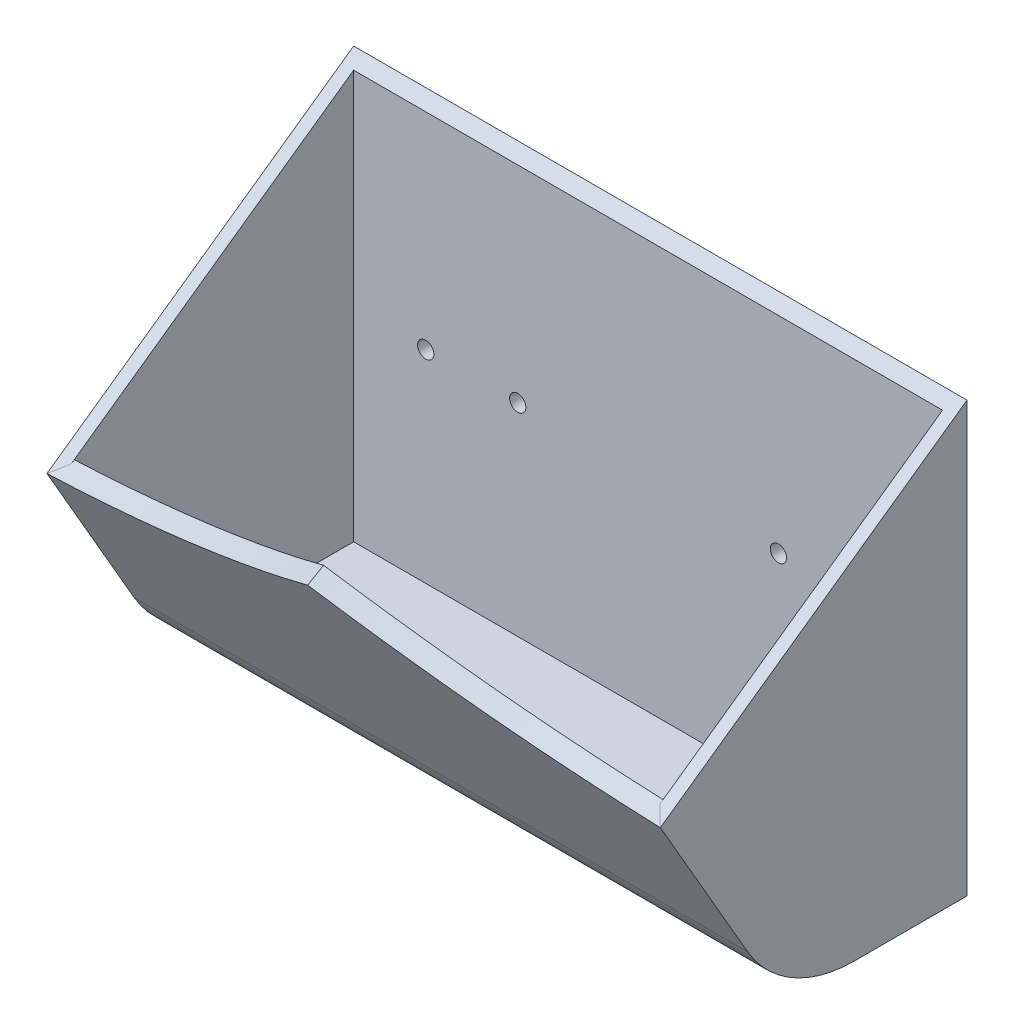
ISO-10303-21;
HEADER;
FILE_DESCRIPTION(('STEP AP214'),'2;1');
FILE_NAME('part.step','',(''),(''),'','','');
FILE_SCHEMA(('AUTOMOTIVE_DESIGN { 1 0 10303 214 1 1 1 1 }'));
ENDSEC;
DATA;
#1=APPLICATION_CONTEXT('core data for automotive mechanical design processes');
#2=APPLICATION_PROTOCOL_DEFINITION('international standard','automotive_design',2000,#1);
#3=PRODUCT_CONTEXT('',#1,'mechanical');
#4=PRODUCT('Part','Part','',(#3));
#5=PRODUCT_RELATED_PRODUCT_CATEGORY('part','',(#4));
#6=PRODUCT_DEFINITION_FORMATION('','',#4);
#7=PRODUCT_DEFINITION_CONTEXT('part definition',#1,'design');
#8=PRODUCT_DEFINITION('design','',#6,#7);
#9=PRODUCT_DEFINITION_SHAPE('','',#8);
#10=(LENGTH_UNIT() NAMED_UNIT(*) SI_UNIT(.MILLI.,.METRE.));
#11=(NAMED_UNIT(*) PLANE_ANGLE_UNIT() SI_UNIT($,.RADIAN.));
#12=(NAMED_UNIT(*) SI_UNIT($,.STERADIAN.) SOLID_ANGLE_UNIT());
#13=UNCERTAINTY_MEASURE_WITH_UNIT(LENGTH_MEASURE(1.E-05),#10,'distance_accuracy_value','');
#14=(GEOMETRIC_REPRESENTATION_CONTEXT(3) GLOBAL_UNCERTAINTY_ASSIGNED_CONTEXT((#13)) GLOBAL_UNIT_ASSIGNED_CONTEXT((#10,
#11,#12)) REPRESENTATION_CONTEXT('',''));
#15=CARTESIAN_POINT('',(0.,0.,0.));
#16=DIRECTION('',(0.,0.,1.));
#17=DIRECTION('',(1.,0.,0.));
#18=AXIS2_PLACEMENT_3D('',#15,#16,#17);
#19=CARTESIAN_POINT('',(63.5,5.89409051224952,63.4999999999999));
#20=DIRECTION('',(0.,-0.816468523326717,-0.577389946584361));
#21=DIRECTION('',(0.,0.577389946584361,-0.816468523326717));
#22=AXIS2_PLACEMENT_3D('',#19,#20,#21);
#23=PLANE('',#22);
#24=DIRECTION('',(0.,-0.57738994658436,0.816468523326717));
#25=VECTOR('',#24,1.);
#26=CARTESIAN_POINT('',(-63.5,5.89409051224952,63.4999999999999));
#27=LINE('',#26,#25);
#28=CARTESIAN_POINT('',(-63.5,50.8,0.));
#29=VERTEX_POINT('',#28);
#30=CARTESIAN_POINT('',(-63.5,5.89409051224952,63.4999999999999));
#31=VERTEX_POINT('',#30);
#32=EDGE_CURVE('E200',#29,#31,#27,.T.);
#33=ORIENTED_EDGE('',*,*,#32,.T.);
#34=CARTESIAN_POINT('',(-81.9447095859,1118.15912687989,-1509.31815723188));
#35=DIRECTION('',(0.,-0.816468523326717,-0.577389946584361));
#36=DIRECTION('',(0.,-0.577389946584361,0.816468523326717));
#37=AXIS2_PLACEMENT_3D('',#34,#35,#36);
#38=ELLIPSE('',#37,1936.81706295664,177.8);
#39=CARTESIAN_POINT('',(-60.96,7.67653522514776,60.9795023514685));
#40=VERTEX_POINT('',#39);
#41=EDGE_CURVE('E181',#31,#40,#38,.F.);
#42=ORIENTED_EDGE('',*,*,#41,.T.);
#43=DIRECTION('',(0.,-0.577389946584361,0.816468523326717));
#44=VECTOR('',#43,1.);
#45=CARTESIAN_POINT('',(-60.96,5.89409051224952,63.4999999999999));
#46=LINE('',#45,#44);
#47=CARTESIAN_POINT('',(-60.96,49.00376362049,2.54));
#48=VERTEX_POINT('',#47);
#49=EDGE_CURVE('E187',#48,#40,#46,.T.);
#50=ORIENTED_EDGE('',*,*,#49,.F.);
#51=DIRECTION('',(-1.,0.,0.));
#52=VECTOR('',#51,1.);
#53=CARTESIAN_POINT('',(63.5,49.00376362049,2.53999999999999));
#54=LINE('',#53,#52);
#55=CARTESIAN_POINT('',(60.96,49.00376362049,2.54));
#56=VERTEX_POINT('',#55);
#57=EDGE_CURVE('E204',#56,#48,#54,.T.);
#58=ORIENTED_EDGE('',*,*,#57,.F.);
#59=DIRECTION('',(0.,-0.577389946584361,0.816468523326717));
#60=VECTOR('',#59,1.);
#61=CARTESIAN_POINT('',(60.96,5.89409051224952,63.4999999999999));
#62=LINE('',#61,#60);
#63=CARTESIAN_POINT('',(60.96,7.67653522514758,60.9795023514688));
#64=VERTEX_POINT('',#63);
#65=EDGE_CURVE('E65',#56,#64,#62,.T.);
#66=ORIENTED_EDGE('',*,*,#65,.T.);
#67=CARTESIAN_POINT('',(81.9447095859,1118.15912687989,-1509.31815723188));
#68=DIRECTION('',(0.,-0.816468523326717,-0.577389946584361));
#69=DIRECTION('',(0.,-0.577389946584361,0.816468523326717));
#70=AXIS2_PLACEMENT_3D('',#67,#68,#69);
#71=ELLIPSE('',#70,1936.81706295664,177.8);
#72=CARTESIAN_POINT('',(63.4999999999999,5.89409051224951,63.4999999999999));
#73=VERTEX_POINT('',#72);
#74=EDGE_CURVE('E184',#64,#73,#71,.F.);
#75=ORIENTED_EDGE('',*,*,#74,.T.);
#76=DIRECTION('',(0.,-0.57738994658436,0.816468523326717));
#77=VECTOR('',#76,1.);
#78=CARTESIAN_POINT('',(63.5,5.89409051224952,63.4999999999999));
#79=LINE('',#78,#77);
#80=CARTESIAN_POINT('',(63.5,50.8,0.));
#81=VERTEX_POINT('',#80);
#82=EDGE_CURVE('E221',#81,#73,#79,.T.);
#83=ORIENTED_EDGE('',*,*,#82,.F.);
#84=DIRECTION('',(-1.,0.,0.));
#85=VECTOR('',#84,1.);
#86=CARTESIAN_POINT('',(63.5,50.8,0.));
#87=LINE('',#86,#85);
#88=EDGE_CURVE('E232',#81,#29,#87,.T.);
#89=ORIENTED_EDGE('',*,*,#88,.T.);
#90=EDGE_LOOP('',(#33,#42,#50,#58,#66,#75,#83,#89));
#91=FACE_BOUND('',#90,.T.);
#92=ADVANCED_FACE('F43',(#91),#23,.F.);
#93=CARTESIAN_POINT('',(63.5,-38.1,38.1));
#94=DIRECTION('',(0.,0.499999999999998,-0.86602540378444));
#95=DIRECTION('',(0.,0.86602540378444,0.499999999999998));
#96=AXIS2_PLACEMENT_3D('',#93,#94,#95);
#97=PLANE('',#96);
#98=DIRECTION('',(0.,-0.86602540378444,-0.499999999999998));
#99=VECTOR('',#98,1.);
#100=CARTESIAN_POINT('',(-63.5,-38.1,38.1));
#101=LINE('',#100,#99);
#102=CARTESIAN_POINT('',(-63.5,-25.4,45.4323484187082));
#103=VERTEX_POINT('',#102);
#104=EDGE_CURVE('E235',#31,#103,#101,.T.);
#105=ORIENTED_EDGE('',*,*,#104,.T.);
#106=DIRECTION('',(-1.,0.,0.));
#107=VECTOR('',#106,1.);
#108=CARTESIAN_POINT('',(63.5,-25.4,45.4323484187082));
#109=LINE('',#108,#107);
#110=CARTESIAN_POINT('',(63.5,-25.4,45.4323484187082));
#111=VERTEX_POINT('',#110);
#112=EDGE_CURVE('E251',#103,#111,#109,.F.);
#113=ORIENTED_EDGE('',*,*,#112,.T.);
#114=DIRECTION('',(0.,-0.86602540378444,-0.499999999999998));
#115=VECTOR('',#114,1.);
#116=CARTESIAN_POINT('',(63.5,-38.1,38.1));
#117=LINE('',#116,#115);
#118=EDGE_CURVE('E224',#73,#111,#117,.T.);
#119=ORIENTED_EDGE('',*,*,#118,.F.);
#120=CARTESIAN_POINT('',(81.9447095859,159.042627939869,151.920349309833));
#121=DIRECTION('',(0.,0.499999999999998,-0.86602540378444));
#122=DIRECTION('',(0.,-0.86602540378444,-0.499999999999998));
#123=AXIS2_PLACEMENT_3D('',#120,#121,#122);
#124=CIRCLE('',#123,177.8);
#125=CARTESIAN_POINT('',(0.,22.3918744543431,73.0249999999998));
#126=VERTEX_POINT('',#125);
#127=EDGE_CURVE('E165',#73,#126,#124,.T.);
#128=ORIENTED_EDGE('',*,*,#127,.T.);
#129=CARTESIAN_POINT('',(-81.9447095859,159.042627939869,151.920349309833));
#130=DIRECTION('',(0.,0.499999999999998,-0.86602540378444));
#131=DIRECTION('',(0.,-0.86602540378444,-0.499999999999998));
#132=AXIS2_PLACEMENT_3D('',#129,#130,#131);
#133=CIRCLE('',#132,177.8);
#134=EDGE_CURVE('E158',#126,#31,#133,.T.);
#135=ORIENTED_EDGE('',*,*,#134,.T.);
#136=EDGE_LOOP('',(#105,#113,#119,#128,#135));
#137=FACE_BOUND('',#136,.T.);
#138=ADVANCED_FACE('F271',(#137),#97,.F.);
#139=CARTESIAN_POINT('',(63.5,-38.1,0.));
#140=DIRECTION('',(0.,1.,0.));
#141=DIRECTION('',(0.,0.,1.));
#142=AXIS2_PLACEMENT_3D('',#139,#140,#141);
#143=PLANE('',#142);
#144=DIRECTION('',(0.,0.,-1.));
#145=VECTOR('',#144,1.);
#146=CARTESIAN_POINT('',(63.5,-38.1,0.));
#147=LINE('',#146,#145);
#148=CARTESIAN_POINT('',(63.5,-38.1,23.4353031625835));
#149=VERTEX_POINT('',#148);
#150=CARTESIAN_POINT('',(63.5,-38.1,0.));
#151=VERTEX_POINT('',#150);
#152=EDGE_CURVE('E228',#149,#151,#147,.T.);
#153=ORIENTED_EDGE('',*,*,#152,.F.);
#154=DIRECTION('',(-1.,0.,0.));
#155=VECTOR('',#154,1.);
#156=CARTESIAN_POINT('',(63.5,-38.1,23.4353031625835));
#157=LINE('',#156,#155);
#158=CARTESIAN_POINT('',(-63.5,-38.1,23.4353031625835));
#159=VERTEX_POINT('',#158);
#160=EDGE_CURVE('E246',#149,#159,#157,.T.);
#161=ORIENTED_EDGE('',*,*,#160,.T.);
#162=DIRECTION('',(0.,0.,-1.));
#163=VECTOR('',#162,1.);
#164=CARTESIAN_POINT('',(-63.5,-38.1,0.));
#165=LINE('',#164,#163);
#166=CARTESIAN_POINT('',(-63.5,-38.1,0.));
#167=VERTEX_POINT('',#166);
#168=EDGE_CURVE('E238',#159,#167,#165,.T.);
#169=ORIENTED_EDGE('',*,*,#168,.T.);
#170=DIRECTION('',(-1.,0.,0.));
#171=VECTOR('',#170,1.);
#172=CARTESIAN_POINT('',(63.5,-38.1,0.));
#173=LINE('',#172,#171);
#174=EDGE_CURVE('E243',#151,#167,#173,.T.);
#175=ORIENTED_EDGE('',*,*,#174,.F.);
#176=EDGE_LOOP('',(#153,#161,#169,#175));
#177=FACE_BOUND('',#176,.T.);
#178=ADVANCED_FACE('F290',(#177),#143,.F.);
#179=CARTESIAN_POINT('',(63.5,50.8,0.));
#180=DIRECTION('',(0.,0.,1.));
#181=DIRECTION('',(1.,0.,0.));
#182=AXIS2_PLACEMENT_3D('',#179,#180,#181);
#183=PLANE('',#182);
#184=CARTESIAN_POINT('',(46.0375,6.35000000000001,0.));
#185=DIRECTION('',(0.,0.,-1.));
#186=DIRECTION('',(-1.,0.,0.));
#187=AXIS2_PLACEMENT_3D('',#184,#185,#186);
#188=CIRCLE('',#187,1.6891);
#189=CARTESIAN_POINT('',(44.3484,6.35000000000001,0.));
#190=VERTEX_POINT('',#189);
#191=EDGE_CURVE('E173',#190,#190,#188,.T.);
#192=ORIENTED_EDGE('',*,*,#191,.F.);
#193=EDGE_LOOP('',(#192));
#194=FACE_BOUND('',#193,.T.);
#195=CARTESIAN_POINT('',(26.9875,6.35000000000001,0.));
#196=DIRECTION('',(0.,0.,-1.));
#197=DIRECTION('',(-1.,0.,0.));
#198=AXIS2_PLACEMENT_3D('',#195,#196,#197);
#199=CIRCLE('',#198,1.6891);
#200=CARTESIAN_POINT('',(25.2984,6.35000000000001,0.));
#201=VERTEX_POINT('',#200);
#202=EDGE_CURVE('E497',#201,#201,#199,.T.);
#203=ORIENTED_EDGE('',*,*,#202,.F.);
#204=EDGE_LOOP('',(#203));
#205=FACE_BOUND('',#204,.T.);
#206=CARTESIAN_POINT('',(-26.9875,6.35000000000001,0.));
#207=DIRECTION('',(0.,0.,-1.));
#208=DIRECTION('',(-1.,0.,0.));
#209=AXIS2_PLACEMENT_3D('',#206,#207,#208);
#210=CIRCLE('',#209,1.6891);
#211=CARTESIAN_POINT('',(-28.6766,6.35000000000001,0.));
#212=VERTEX_POINT('',#211);
#213=EDGE_CURVE('E503',#212,#212,#210,.T.);
#214=ORIENTED_EDGE('',*,*,#213,.F.);
#215=EDGE_LOOP('',(#214));
#216=FACE_BOUND('',#215,.T.);
#217=CARTESIAN_POINT('',(-46.0375,6.35000000000001,0.));
#218=DIRECTION('',(0.,0.,-1.));
#219=DIRECTION('',(-1.,0.,0.));
#220=AXIS2_PLACEMENT_3D('',#217,#218,#219);
#221=CIRCLE('',#220,1.6891);
#222=CARTESIAN_POINT('',(-47.7266,6.35000000000001,0.));
#223=VERTEX_POINT('',#222);
#224=EDGE_CURVE('E507',#223,#223,#221,.T.);
#225=ORIENTED_EDGE('',*,*,#224,.F.);
#226=EDGE_LOOP('',(#225));
#227=FACE_BOUND('',#226,.T.);
#228=DIRECTION('',(0.,1.,0.));
#229=VECTOR('',#228,1.);
#230=CARTESIAN_POINT('',(-63.5,50.8,0.));
#231=LINE('',#230,#229);
#232=EDGE_CURVE('E225',#167,#29,#231,.T.);
#233=ORIENTED_EDGE('',*,*,#232,.T.);
#234=ORIENTED_EDGE('',*,*,#88,.F.);
#235=DIRECTION('',(0.,1.,0.));
#236=VECTOR('',#235,1.);
#237=CARTESIAN_POINT('',(63.5,50.8,0.));
#238=LINE('',#237,#236);
#239=EDGE_CURVE('E230',#151,#81,#238,.T.);
#240=ORIENTED_EDGE('',*,*,#239,.F.);
#241=ORIENTED_EDGE('',*,*,#174,.T.);
#242=EDGE_LOOP('',(#233,#234,#240,#241));
#243=FACE_BOUND('',#242,.T.);
#244=ADVANCED_FACE('F281',(#194,#205,#216,#227,#243),#183,.F.);
#245=CARTESIAN_POINT('',(63.5,0.,0.));
#246=DIRECTION('',(1.,0.,0.));
#247=DIRECTION('',(0.,0.,-1.));
#248=AXIS2_PLACEMENT_3D('',#245,#246,#247);
#249=PLANE('',#248);
#250=ORIENTED_EDGE('',*,*,#118,.T.);
#251=CARTESIAN_POINT('',(63.5,-12.7,23.4353031625835));
#252=DIRECTION('',(1.,0.,0.));
#253=DIRECTION('',(0.,0.,-1.));
#254=AXIS2_PLACEMENT_3D('',#251,#252,#253);
#255=CIRCLE('',#254,25.4);
#256=EDGE_CURVE('E253',#111,#149,#255,.T.);
#257=ORIENTED_EDGE('',*,*,#256,.T.);
#258=ORIENTED_EDGE('',*,*,#152,.T.);
#259=ORIENTED_EDGE('',*,*,#239,.T.);
#260=ORIENTED_EDGE('',*,*,#82,.T.);
#261=EDGE_LOOP('',(#250,#257,#258,#259,#260));
#262=FACE_BOUND('',#261,.T.);
#263=ADVANCED_FACE('F275',(#262),#249,.T.);
#264=CARTESIAN_POINT('',(-63.5,0.,0.));
#265=DIRECTION('',(1.,0.,0.));
#266=DIRECTION('',(0.,0.,-1.));
#267=AXIS2_PLACEMENT_3D('',#264,#265,#266);
#268=PLANE('',#267);
#269=ORIENTED_EDGE('',*,*,#168,.F.);
#270=CARTESIAN_POINT('',(-63.5,-12.7,23.4353031625835));
#271=DIRECTION('',(1.,0.,0.));
#272=DIRECTION('',(0.,0.,-1.));
#273=AXIS2_PLACEMENT_3D('',#270,#271,#272);
#274=CIRCLE('',#273,25.4);
#275=EDGE_CURVE('E249',#159,#103,#274,.F.);
#276=ORIENTED_EDGE('',*,*,#275,.T.);
#277=ORIENTED_EDGE('',*,*,#104,.F.);
#278=ORIENTED_EDGE('',*,*,#32,.F.);
#279=ORIENTED_EDGE('',*,*,#232,.F.);
#280=EDGE_LOOP('',(#269,#276,#277,#278,#279));
#281=FACE_BOUND('',#280,.T.);
#282=ADVANCED_FACE('F286',(#281),#268,.F.);
#283=CARTESIAN_POINT('',(63.5,-12.7,23.4353031625835));
#284=DIRECTION('',(-1.,0.,0.));
#285=DIRECTION('',(0.,0.,1.));
#286=AXIS2_PLACEMENT_3D('',#283,#284,#285);
#287=CYLINDRICAL_SURFACE('',#286,25.4);
#288=ORIENTED_EDGE('',*,*,#256,.F.);
#289=ORIENTED_EDGE('',*,*,#112,.F.);
#290=ORIENTED_EDGE('',*,*,#275,.F.);
#291=ORIENTED_EDGE('',*,*,#160,.F.);
#292=EDGE_LOOP('',(#288,#289,#290,#291));
#293=FACE_BOUND('',#292,.T.);
#294=ADVANCED_FACE('F45',(#293),#287,.T.);
#295=CARTESIAN_POINT('',(63.5,-36.83,35.9002954743875));
#296=DIRECTION('',(0.,0.499999999999998,-0.86602540378444));
#297=DIRECTION('',(0.,0.86602540378444,0.499999999999998));
#298=AXIS2_PLACEMENT_3D('',#295,#296,#297);
#299=PLANE('',#298);
#300=DIRECTION('',(-1.,0.,0.));
#301=VECTOR('',#300,1.);
#302=CARTESIAN_POINT('',(63.5,7.16409051224952,61.3002954743874));
#303=LINE('',#302,#301);
#304=CARTESIAN_POINT('',(60.96,7.16409051224952,61.3002954743874));
#305=VERTEX_POINT('',#304);
#306=CARTESIAN_POINT('',(-60.96,7.16409051224951,61.3002954743874));
#307=VERTEX_POINT('',#306);
#308=EDGE_CURVE('E176',#305,#307,#303,.T.);
#309=ORIENTED_EDGE('',*,*,#308,.F.);
#310=DIRECTION('',(0.,-0.86602540378444,-0.499999999999998));
#311=VECTOR('',#310,1.);
#312=CARTESIAN_POINT('',(60.96,-36.83,35.9002954743875));
#313=LINE('',#312,#311);
#314=CARTESIAN_POINT('',(60.96,-24.13,43.2326438930958));
#315=VERTEX_POINT('',#314);
#316=EDGE_CURVE('E196',#305,#315,#313,.T.);
#317=ORIENTED_EDGE('',*,*,#316,.T.);
#318=DIRECTION('',(1.,0.,0.));
#319=VECTOR('',#318,1.);
#320=CARTESIAN_POINT('',(63.5,-24.13,43.2326438930958));
#321=LINE('',#320,#319);
#322=CARTESIAN_POINT('',(-60.96,-24.13,43.2326438930958));
#323=VERTEX_POINT('',#322);
#324=EDGE_CURVE('E191',#323,#315,#321,.T.);
#325=ORIENTED_EDGE('',*,*,#324,.F.);
#326=DIRECTION('',(0.,-0.86602540378444,-0.499999999999998));
#327=VECTOR('',#326,1.);
#328=CARTESIAN_POINT('',(-60.96,-36.83,35.9002954743875));
#329=LINE('',#328,#327);
#330=EDGE_CURVE('E188',#307,#323,#329,.T.);
#331=ORIENTED_EDGE('',*,*,#330,.F.);
#332=EDGE_LOOP('',(#309,#317,#325,#331));
#333=FACE_BOUND('',#332,.T.);
#334=ADVANCED_FACE('F336',(#333),#299,.T.);
#335=CARTESIAN_POINT('',(63.5,-35.56,0.));
#336=DIRECTION('',(0.,1.,0.));
#337=DIRECTION('',(0.,0.,1.));
#338=AXIS2_PLACEMENT_3D('',#335,#336,#337);
#339=PLANE('',#338);
#340=DIRECTION('',(0.,0.,-1.));
#341=VECTOR('',#340,1.);
#342=CARTESIAN_POINT('',(60.96,-35.56,0.));
#343=LINE('',#342,#341);
#344=CARTESIAN_POINT('',(60.96,-35.56,23.4353031625835));
#345=VERTEX_POINT('',#344);
#346=CARTESIAN_POINT('',(60.96,-35.56,2.54));
#347=VERTEX_POINT('',#346);
#348=EDGE_CURVE('E198',#345,#347,#343,.T.);
#349=ORIENTED_EDGE('',*,*,#348,.T.);
#350=DIRECTION('',(-1.,0.,0.));
#351=VECTOR('',#350,1.);
#352=CARTESIAN_POINT('',(63.5,-35.56,2.54));
#353=LINE('',#352,#351);
#354=CARTESIAN_POINT('',(-60.96,-35.56,2.54));
#355=VERTEX_POINT('',#354);
#356=EDGE_CURVE('E208',#347,#355,#353,.T.);
#357=ORIENTED_EDGE('',*,*,#356,.T.);
#358=DIRECTION('',(0.,0.,-1.));
#359=VECTOR('',#358,1.);
#360=CARTESIAN_POINT('',(-60.96,-35.56,0.));
#361=LINE('',#360,#359);
#362=CARTESIAN_POINT('',(-60.96,-35.56,23.4353031625835));
#363=VERTEX_POINT('',#362);
#364=EDGE_CURVE('E190',#363,#355,#361,.T.);
#365=ORIENTED_EDGE('',*,*,#364,.F.);
#366=DIRECTION('',(1.,0.,0.));
#367=VECTOR('',#366,1.);
#368=CARTESIAN_POINT('',(63.5,-35.56,23.4353031625835));
#369=LINE('',#368,#367);
#370=EDGE_CURVE('E205',#345,#363,#369,.F.);
#371=ORIENTED_EDGE('',*,*,#370,.F.);
#372=EDGE_LOOP('',(#349,#357,#365,#371));
#373=FACE_BOUND('',#372,.T.);
#374=ADVANCED_FACE('F340',(#373),#339,.T.);
#375=CARTESIAN_POINT('',(63.5,50.8,2.54));
#376=DIRECTION('',(0.,0.,1.));
#377=DIRECTION('',(1.,0.,0.));
#378=AXIS2_PLACEMENT_3D('',#375,#376,#377);
#379=PLANE('',#378);
#380=CARTESIAN_POINT('',(46.0375,6.35000000000001,2.54));
#381=DIRECTION('',(0.,0.,1.));
#382=DIRECTION('',(1.,0.,0.));
#383=AXIS2_PLACEMENT_3D('',#380,#381,#382);
#384=CIRCLE('',#383,1.6891);
#385=CARTESIAN_POINT('',(47.7266,6.35000000000001,2.54));
#386=VERTEX_POINT('',#385);
#387=EDGE_CURVE('E490',#386,#386,#384,.F.);
#388=ORIENTED_EDGE('',*,*,#387,.T.);
#389=EDGE_LOOP('',(#388));
#390=FACE_BOUND('',#389,.T.);
#391=CARTESIAN_POINT('',(26.9875,6.35000000000001,2.54));
#392=DIRECTION('',(0.,0.,1.));
#393=DIRECTION('',(1.,0.,0.));
#394=AXIS2_PLACEMENT_3D('',#391,#392,#393);
#395=CIRCLE('',#394,1.6891);
#396=CARTESIAN_POINT('',(28.6766,6.35000000000001,2.54));
#397=VERTEX_POINT('',#396);
#398=EDGE_CURVE('E494',#397,#397,#395,.F.);
#399=ORIENTED_EDGE('',*,*,#398,.T.);
#400=EDGE_LOOP('',(#399));
#401=FACE_BOUND('',#400,.T.);
#402=CARTESIAN_POINT('',(-26.9875,6.35000000000001,2.54));
#403=DIRECTION('',(0.,0.,1.));
#404=DIRECTION('',(1.,0.,0.));
#405=AXIS2_PLACEMENT_3D('',#402,#403,#404);
#406=CIRCLE('',#405,1.6891);
#407=CARTESIAN_POINT('',(-25.2984,6.35000000000001,2.54));
#408=VERTEX_POINT('',#407);
#409=EDGE_CURVE('E500',#408,#408,#406,.F.);
#410=ORIENTED_EDGE('',*,*,#409,.T.);
#411=EDGE_LOOP('',(#410));
#412=FACE_BOUND('',#411,.T.);
#413=CARTESIAN_POINT('',(-46.0375,6.35000000000001,2.54));
#414=DIRECTION('',(0.,0.,1.));
#415=DIRECTION('',(1.,0.,0.));
#416=AXIS2_PLACEMENT_3D('',#413,#414,#415);
#417=CIRCLE('',#416,1.6891);
#418=CARTESIAN_POINT('',(-44.3484,6.35000000000001,2.54));
#419=VERTEX_POINT('',#418);
#420=EDGE_CURVE('E170',#419,#419,#417,.F.);
#421=ORIENTED_EDGE('',*,*,#420,.T.);
#422=EDGE_LOOP('',(#421));
#423=FACE_BOUND('',#422,.T.);
#424=DIRECTION('',(0.,1.,0.));
#425=VECTOR('',#424,1.);
#426=CARTESIAN_POINT('',(-60.96,50.8,2.54));
#427=LINE('',#426,#425);
#428=EDGE_CURVE('E210',#355,#48,#427,.T.);
#429=ORIENTED_EDGE('',*,*,#428,.F.);
#430=ORIENTED_EDGE('',*,*,#356,.F.);
#431=DIRECTION('',(0.,1.,0.));
#432=VECTOR('',#431,1.);
#433=CARTESIAN_POINT('',(60.96,50.8,2.54));
#434=LINE('',#433,#432);
#435=EDGE_CURVE('E202',#347,#56,#434,.T.);
#436=ORIENTED_EDGE('',*,*,#435,.T.);
#437=ORIENTED_EDGE('',*,*,#57,.T.);
#438=EDGE_LOOP('',(#429,#430,#436,#437));
#439=FACE_BOUND('',#438,.T.);
#440=ADVANCED_FACE('F267',(#390,#401,#412,#423,#439),#379,.T.);
#441=CARTESIAN_POINT('',(60.96,0.,0.));
#442=DIRECTION('',(1.,0.,0.));
#443=DIRECTION('',(0.,0.,-1.));
#444=AXIS2_PLACEMENT_3D('',#441,#442,#443);
#445=PLANE('',#444);
#446=DIRECTION('',(0.,-0.86602540378444,-0.499999999999998));
#447=VECTOR('',#446,1.);
#448=CARTESIAN_POINT('',(60.96,-24.1177839420934,41.7732271536749));
#449=LINE('',#448,#447);
#450=CARTESIAN_POINT('',(60.96,8.04451655001959,60.3421400005539));
#451=VERTEX_POINT('',#450);
#452=CARTESIAN_POINT('',(60.96,7.79909051224951,60.2004432115812));
#453=VERTEX_POINT('',#452);
#454=EDGE_CURVE('E160',#451,#453,#449,.T.);
#455=ORIENTED_EDGE('',*,*,#454,.F.);
#456=DIRECTION('',(0.,-0.499999999999998,0.86602540378444));
#457=VECTOR('',#456,1.);
#458=CARTESIAN_POINT('',(60.96,8.04451655001962,60.3421400005539));
#459=LINE('',#458,#457);
#460=EDGE_CURVE('E11',#451,#64,#459,.T.);
#461=ORIENTED_EDGE('',*,*,#460,.T.);
#462=ORIENTED_EDGE('',*,*,#65,.F.);
#463=ORIENTED_EDGE('',*,*,#435,.F.);
#464=ORIENTED_EDGE('',*,*,#348,.F.);
#465=CARTESIAN_POINT('',(60.96,-12.7,23.4353031625835));
#466=DIRECTION('',(1.,0.,0.));
#467=DIRECTION('',(0.,0.,-1.));
#468=AXIS2_PLACEMENT_3D('',#465,#466,#467);
#469=CIRCLE('',#468,22.86);
#470=EDGE_CURVE('E194',#315,#345,#469,.T.);
#471=ORIENTED_EDGE('',*,*,#470,.F.);
#472=ORIENTED_EDGE('',*,*,#316,.F.);
#473=DIRECTION('',(0.,0.499999999999998,-0.86602540378444));
#474=VECTOR('',#473,1.);
#475=CARTESIAN_POINT('',(60.96,31.916874454343,18.4272160579063));
#476=LINE('',#475,#474);
#477=EDGE_CURVE('E178',#305,#453,#476,.T.);
#478=ORIENTED_EDGE('',*,*,#477,.T.);
#479=EDGE_LOOP('',(#455,#461,#462,#463,#464,#471,#472,#478));
#480=FACE_BOUND('',#479,.T.);
#481=ADVANCED_FACE('F346',(#480),#445,.F.);
#482=CARTESIAN_POINT('',(-60.96,0.,0.));
#483=DIRECTION('',(1.,0.,0.));
#484=DIRECTION('',(0.,0.,-1.));
#485=AXIS2_PLACEMENT_3D('',#482,#483,#484);
#486=PLANE('',#485);
#487=DIRECTION('',(0.,-0.499999999999998,0.86602540378444));
#488=VECTOR('',#487,1.);
#489=CARTESIAN_POINT('',(-60.96,8.04451655001964,60.3421400005539));
#490=LINE('',#489,#488);
#491=CARTESIAN_POINT('',(-60.96,8.04451655001962,60.3421400005539));
#492=VERTEX_POINT('',#491);
#493=EDGE_CURVE('E51',#492,#40,#490,.T.);
#494=ORIENTED_EDGE('',*,*,#493,.F.);
#495=DIRECTION('',(0.,-0.86602540378444,-0.499999999999998));
#496=VECTOR('',#495,1.);
#497=CARTESIAN_POINT('',(-60.96,-24.1177839420934,41.7732271536749));
#498=LINE('',#497,#496);
#499=CARTESIAN_POINT('',(-60.96,7.79909051224951,60.2004432115812));
#500=VERTEX_POINT('',#499);
#501=EDGE_CURVE('E164',#492,#500,#498,.T.);
#502=ORIENTED_EDGE('',*,*,#501,.T.);
#503=DIRECTION('',(0.,0.499999999999998,-0.86602540378444));
#504=VECTOR('',#503,1.);
#505=CARTESIAN_POINT('',(-60.96,31.916874454343,18.4272160579063));
#506=LINE('',#505,#504);
#507=EDGE_CURVE('E256',#307,#500,#506,.T.);
#508=ORIENTED_EDGE('',*,*,#507,.F.);
#509=ORIENTED_EDGE('',*,*,#330,.T.);
#510=CARTESIAN_POINT('',(-60.96,-12.7,23.4353031625835));
#511=DIRECTION('',(1.,0.,0.));
#512=DIRECTION('',(0.,0.,-1.));
#513=AXIS2_PLACEMENT_3D('',#510,#511,#512);
#514=CIRCLE('',#513,22.86);
#515=EDGE_CURVE('E195',#363,#323,#514,.F.);
#516=ORIENTED_EDGE('',*,*,#515,.F.);
#517=ORIENTED_EDGE('',*,*,#364,.T.);
#518=ORIENTED_EDGE('',*,*,#428,.T.);
#519=ORIENTED_EDGE('',*,*,#49,.T.);
#520=EDGE_LOOP('',(#494,#502,#508,#509,#516,#517,#518,#519));
#521=FACE_BOUND('',#520,.T.);
#522=ADVANCED_FACE('F262',(#521),#486,.T.);
#523=CARTESIAN_POINT('',(63.5,-12.7,23.4353031625835));
#524=DIRECTION('',(-1.,0.,0.));
#525=DIRECTION('',(0.,0.,1.));
#526=AXIS2_PLACEMENT_3D('',#523,#524,#525);
#527=CYLINDRICAL_SURFACE('',#526,22.86);
#528=ORIENTED_EDGE('',*,*,#470,.T.);
#529=ORIENTED_EDGE('',*,*,#370,.T.);
#530=ORIENTED_EDGE('',*,*,#515,.T.);
#531=ORIENTED_EDGE('',*,*,#324,.T.);
#532=EDGE_LOOP('',(#528,#529,#530,#531));
#533=FACE_BOUND('',#532,.T.);
#534=ADVANCED_FACE('F309',(#533),#527,.F.);
#535=CARTESIAN_POINT('',(81.9447095859,160.947627939869,148.620792521414));
#536=DIRECTION('',(0.,-0.499999999999998,0.86602540378444));
#537=DIRECTION('',(0.,-0.86602540378444,-0.499999999999998));
#538=AXIS2_PLACEMENT_3D('',#535,#536,#537);
#539=CYLINDRICAL_SURFACE('',#538,177.8);
#540=ORIENTED_EDGE('',*,*,#74,.F.);
#541=ORIENTED_EDGE('',*,*,#460,.F.);
#542=CARTESIAN_POINT('',(81.9447095859,160.947627939869,148.620792521414));
#543=DIRECTION('',(0.,0.499999999999998,-0.86602540378444));
#544=DIRECTION('',(0.,-0.86602540378444,-0.499999999999998));
#545=AXIS2_PLACEMENT_3D('',#542,#543,#544);
#546=CIRCLE('',#545,177.8);
#547=CARTESIAN_POINT('',(0.,24.2968744543431,69.7254432115811));
#548=VERTEX_POINT('',#547);
#549=EDGE_CURVE('E144',#451,#548,#546,.T.);
#550=ORIENTED_EDGE('',*,*,#549,.T.);
#551=DIRECTION('',(0.,-0.499999999999998,0.86602540378444));
#552=VECTOR('',#551,1.);
#553=CARTESIAN_POINT('',(0.,24.2968744543431,69.7254432115811));
#554=LINE('',#553,#552);
#555=EDGE_CURVE('E147',#548,#126,#554,.T.);
#556=ORIENTED_EDGE('',*,*,#555,.T.);
#557=ORIENTED_EDGE('',*,*,#127,.F.);
#558=EDGE_LOOP('',(#540,#541,#550,#556,#557));
#559=FACE_BOUND('',#558,.T.);
#560=ADVANCED_FACE('F146',(#559),#539,.F.);
#561=CARTESIAN_POINT('',(-81.9447095859,160.947627939869,148.620792521414));
#562=DIRECTION('',(0.,-0.499999999999998,0.86602540378444));
#563=DIRECTION('',(0.,-0.86602540378444,-0.499999999999998));
#564=AXIS2_PLACEMENT_3D('',#561,#562,#563);
#565=CYLINDRICAL_SURFACE('',#564,177.8);
#566=ORIENTED_EDGE('',*,*,#41,.F.);
#567=ORIENTED_EDGE('',*,*,#134,.F.);
#568=ORIENTED_EDGE('',*,*,#555,.F.);
#569=CARTESIAN_POINT('',(-81.9447095859,160.947627939869,148.620792521414));
#570=DIRECTION('',(0.,0.499999999999998,-0.86602540378444));
#571=DIRECTION('',(0.,-0.86602540378444,-0.499999999999998));
#572=AXIS2_PLACEMENT_3D('',#569,#570,#571);
#573=CIRCLE('',#572,177.8);
#574=EDGE_CURVE('E155',#548,#492,#573,.T.);
#575=ORIENTED_EDGE('',*,*,#574,.T.);
#576=ORIENTED_EDGE('',*,*,#493,.T.);
#577=EDGE_LOOP('',(#566,#567,#568,#575,#576));
#578=FACE_BOUND('',#577,.T.);
#579=ADVANCED_FACE('F154',(#578),#565,.F.);
#580=CARTESIAN_POINT('',(-63.5,7.79909051224951,60.2004432115812));
#581=DIRECTION('',(0.,-0.86602540378444,-0.499999999999998));
#582=DIRECTION('',(0.,0.499999999999998,-0.86602540378444));
#583=AXIS2_PLACEMENT_3D('',#580,#581,#582);
#584=PLANE('',#583);
#585=ORIENTED_EDGE('',*,*,#477,.F.);
#586=ORIENTED_EDGE('',*,*,#308,.T.);
#587=ORIENTED_EDGE('',*,*,#507,.T.);
#588=DIRECTION('',(1.,0.,0.));
#589=VECTOR('',#588,1.);
#590=CARTESIAN_POINT('',(-63.5,7.79909051224951,60.2004432115812));
#591=LINE('',#590,#589);
#592=EDGE_CURVE('E58',#500,#453,#591,.T.);
#593=ORIENTED_EDGE('',*,*,#592,.T.);
#594=EDGE_LOOP('',(#585,#586,#587,#593));
#595=FACE_BOUND('',#594,.T.);
#596=ADVANCED_FACE('F371',(#595),#584,.T.);
#597=CARTESIAN_POINT('',(-81.9447095859,160.947627939869,148.620792521414));
#598=DIRECTION('',(0.,-0.499999999999998,0.86602540378444));
#599=DIRECTION('',(0.,-0.86602540378444,-0.499999999999998));
#600=AXIS2_PLACEMENT_3D('',#597,#598,#599);
#601=PLANE('',#600);
#602=ORIENTED_EDGE('',*,*,#549,.F.);
#603=ORIENTED_EDGE('',*,*,#454,.T.);
#604=ORIENTED_EDGE('',*,*,#592,.F.);
#605=ORIENTED_EDGE('',*,*,#501,.F.);
#606=ORIENTED_EDGE('',*,*,#574,.F.);
#607=EDGE_LOOP('',(#602,#603,#604,#605,#606));
#608=FACE_BOUND('',#607,.T.);
#609=ADVANCED_FACE('F162',(#608),#601,.F.);
#610=CARTESIAN_POINT('',(-46.0375,6.35000000000001,73.0259999999999));
#611=DIRECTION('',(0.,0.,-1.));
#612=DIRECTION('',(-1.,0.,0.));
#613=AXIS2_PLACEMENT_3D('',#610,#611,#612);
#614=CYLINDRICAL_SURFACE('',#613,1.6891);
#615=ORIENTED_EDGE('',*,*,#420,.F.);
#616=EDGE_LOOP('',(#615));
#617=FACE_BOUND('',#616,.T.);
#618=ORIENTED_EDGE('',*,*,#224,.T.);
#619=EDGE_LOOP('',(#618));
#620=FACE_BOUND('',#619,.T.);
#621=ADVANCED_FACE('F386',(#617,#620),#614,.F.);
#622=CARTESIAN_POINT('',(-26.9875,6.35000000000001,73.0259999999999));
#623=DIRECTION('',(0.,0.,-1.));
#624=DIRECTION('',(-1.,0.,0.));
#625=AXIS2_PLACEMENT_3D('',#622,#623,#624);
#626=CYLINDRICAL_SURFACE('',#625,1.6891);
#627=ORIENTED_EDGE('',*,*,#409,.F.);
#628=EDGE_LOOP('',(#627));
#629=FACE_BOUND('',#628,.T.);
#630=ORIENTED_EDGE('',*,*,#213,.T.);
#631=EDGE_LOOP('',(#630));
#632=FACE_BOUND('',#631,.T.);
#633=ADVANCED_FACE('F406',(#629,#632),#626,.F.);
#634=CARTESIAN_POINT('',(26.9875,6.35000000000001,73.0259999999999));
#635=DIRECTION('',(0.,0.,-1.));
#636=DIRECTION('',(-1.,0.,0.));
#637=AXIS2_PLACEMENT_3D('',#634,#635,#636);
#638=CYLINDRICAL_SURFACE('',#637,1.6891);
#639=ORIENTED_EDGE('',*,*,#398,.F.);
#640=EDGE_LOOP('',(#639));
#641=FACE_BOUND('',#640,.T.);
#642=ORIENTED_EDGE('',*,*,#202,.T.);
#643=EDGE_LOOP('',(#642));
#644=FACE_BOUND('',#643,.T.);
#645=ADVANCED_FACE('F415',(#641,#644),#638,.F.);
#646=CARTESIAN_POINT('',(46.0375,6.35000000000001,73.0259999999999));
#647=DIRECTION('',(0.,0.,-1.));
#648=DIRECTION('',(-1.,0.,0.));
#649=AXIS2_PLACEMENT_3D('',#646,#647,#648);
#650=CYLINDRICAL_SURFACE('',#649,1.6891);
#651=ORIENTED_EDGE('',*,*,#387,.F.);
#652=EDGE_LOOP('',(#651));
#653=FACE_BOUND('',#652,.T.);
#654=ORIENTED_EDGE('',*,*,#191,.T.);
#655=EDGE_LOOP('',(#654));
#656=FACE_BOUND('',#655,.T.);
#657=ADVANCED_FACE('F424',(#653,#656),#650,.F.);
#658=CLOSED_SHELL('',(#92,#138,#178,#244,#263,#282,#294,#334,#374,#440,#481,#522,#534,#560,#579,
#596,#609,#621,#633,#645,#657));
#659=MANIFOLD_SOLID_BREP('B2',#658);
#660=ADVANCED_BREP_SHAPE_REPRESENTATION('',(#18,#659),#14);
#661=SHAPE_DEFINITION_REPRESENTATION(#9,#660);
ENDSEC;
END-ISO-10303-21;
